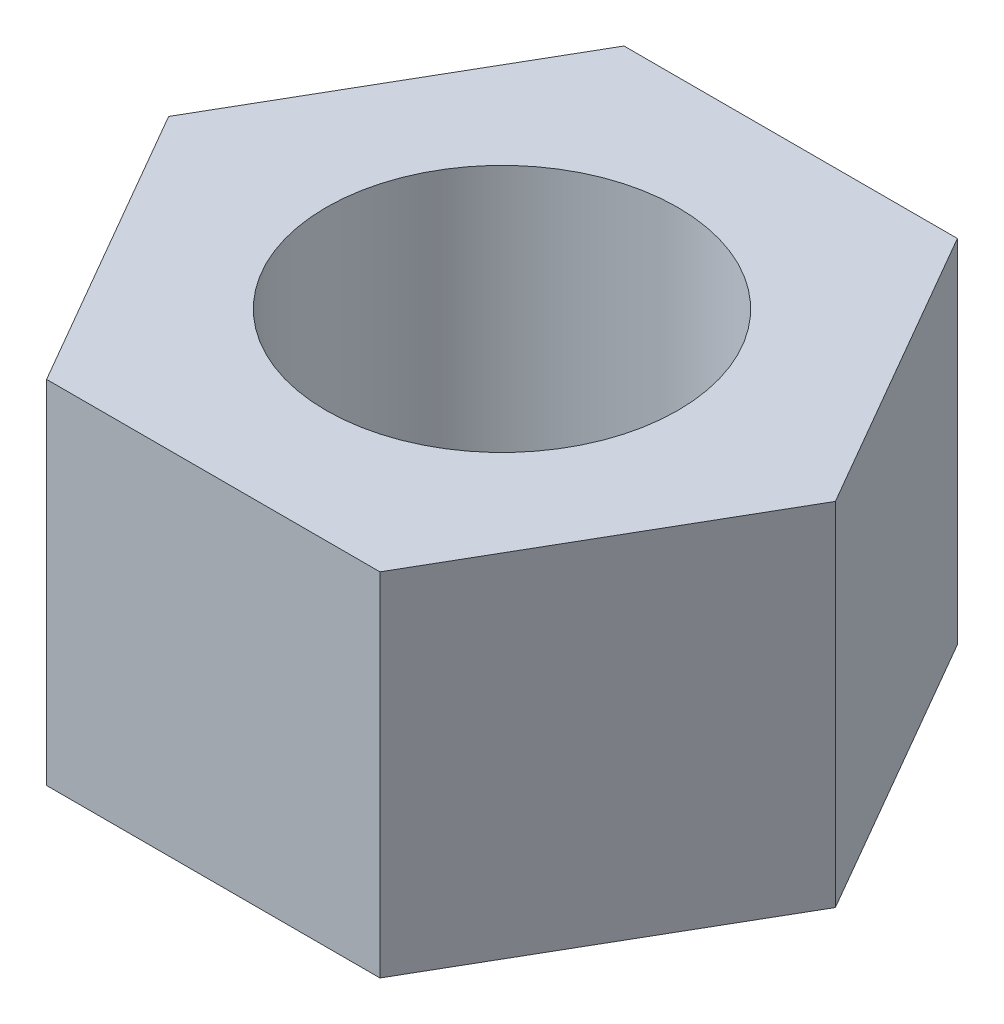
ISO-10303-21;
HEADER;
FILE_DESCRIPTION(('STEP AP214'),'2;1');
FILE_NAME('part.step','',(''),(''),'','','');
FILE_SCHEMA(('AUTOMOTIVE_DESIGN { 1 0 10303 214 1 1 1 1 }'));
ENDSEC;
DATA;
#1=APPLICATION_CONTEXT('core data for automotive mechanical design processes');
#2=APPLICATION_PROTOCOL_DEFINITION('international standard','automotive_design',2000,#1);
#3=PRODUCT_CONTEXT('',#1,'mechanical');
#4=PRODUCT('Part','Part','',(#3));
#5=PRODUCT_RELATED_PRODUCT_CATEGORY('part','',(#4));
#6=PRODUCT_DEFINITION_FORMATION('','',#4);
#7=PRODUCT_DEFINITION_CONTEXT('part definition',#1,'design');
#8=PRODUCT_DEFINITION('design','',#6,#7);
#9=PRODUCT_DEFINITION_SHAPE('','',#8);
#10=(LENGTH_UNIT() NAMED_UNIT(*) SI_UNIT(.MILLI.,.METRE.));
#11=(NAMED_UNIT(*) PLANE_ANGLE_UNIT() SI_UNIT($,.RADIAN.));
#12=(NAMED_UNIT(*) SI_UNIT($,.STERADIAN.) SOLID_ANGLE_UNIT());
#13=UNCERTAINTY_MEASURE_WITH_UNIT(LENGTH_MEASURE(1.E-05),#10,'distance_accuracy_value','');
#14=(GEOMETRIC_REPRESENTATION_CONTEXT(3) GLOBAL_UNCERTAINTY_ASSIGNED_CONTEXT((#13)) GLOBAL_UNIT_ASSIGNED_CONTEXT((#10,
#11,#12)) REPRESENTATION_CONTEXT('',''));
#15=CARTESIAN_POINT('',(0.,0.,0.));
#16=DIRECTION('',(0.,0.,1.));
#17=DIRECTION('',(1.,0.,0.));
#18=AXIS2_PLACEMENT_3D('',#15,#16,#17);
#19=CARTESIAN_POINT('',(0.,6.,0.));
#20=DIRECTION('',(0.,1.,0.));
#21=DIRECTION('',(0.,0.,1.));
#22=AXIS2_PLACEMENT_3D('',#19,#20,#21);
#23=PLANE('',#22);
#24=DIRECTION('',(-0.5,0.,-0.866025403784439));
#25=VECTOR('',#24,1.);
#26=CARTESIAN_POINT('',(5.68690015151781,6.,0.));
#27=LINE('',#26,#25);
#28=CARTESIAN_POINT('',(5.68690015151781,6.,0.));
#29=VERTEX_POINT('',#28);
#30=CARTESIAN_POINT('',(2.84345007575891,6.,-4.925));
#31=VERTEX_POINT('',#30);
#32=EDGE_CURVE('E130',#29,#31,#27,.T.);
#33=ORIENTED_EDGE('',*,*,#32,.T.);
#34=DIRECTION('',(-1.,0.,0.));
#35=VECTOR('',#34,1.);
#36=CARTESIAN_POINT('',(2.84345007575891,6.,-4.925));
#37=LINE('',#36,#35);
#38=CARTESIAN_POINT('',(-2.84345007575891,6.,-4.925));
#39=VERTEX_POINT('',#38);
#40=EDGE_CURVE('E88',#31,#39,#37,.T.);
#41=ORIENTED_EDGE('',*,*,#40,.T.);
#42=DIRECTION('',(-0.5,0.,0.866025403784439));
#43=VECTOR('',#42,1.);
#44=CARTESIAN_POINT('',(-2.84345007575891,6.,-4.925));
#45=LINE('',#44,#43);
#46=CARTESIAN_POINT('',(-5.68690015151781,6.,0.));
#47=VERTEX_POINT('',#46);
#48=EDGE_CURVE('E101',#39,#47,#45,.T.);
#49=ORIENTED_EDGE('',*,*,#48,.T.);
#50=DIRECTION('',(0.5,0.,0.866025403784439));
#51=VECTOR('',#50,1.);
#52=CARTESIAN_POINT('',(-5.68690015151781,6.,0.));
#53=LINE('',#52,#51);
#54=CARTESIAN_POINT('',(-2.8434500757589,6.,4.925));
#55=VERTEX_POINT('',#54);
#56=EDGE_CURVE('E95',#47,#55,#53,.T.);
#57=ORIENTED_EDGE('',*,*,#56,.T.);
#58=DIRECTION('',(1.,0.,0.));
#59=VECTOR('',#58,1.);
#60=CARTESIAN_POINT('',(-2.8434500757589,6.,4.925));
#61=LINE('',#60,#59);
#62=CARTESIAN_POINT('',(2.84345007575891,6.,4.925));
#63=VERTEX_POINT('',#62);
#64=EDGE_CURVE('E99',#55,#63,#61,.T.);
#65=ORIENTED_EDGE('',*,*,#64,.T.);
#66=DIRECTION('',(0.5,0.,-0.866025403784439));
#67=VECTOR('',#66,1.);
#68=CARTESIAN_POINT('',(2.84345007575891,6.,4.925));
#69=LINE('',#68,#67);
#70=EDGE_CURVE('E51',#63,#29,#69,.T.);
#71=ORIENTED_EDGE('',*,*,#70,.T.);
#72=EDGE_LOOP('',(#33,#41,#49,#57,#65,#71));
#73=FACE_BOUND('',#72,.T.);
#74=CARTESIAN_POINT('',(0.,6.,0.));
#75=DIRECTION('',(0.,1.,0.));
#76=DIRECTION('',(0.,0.,1.));
#77=AXIS2_PLACEMENT_3D('',#74,#75,#76);
#78=CIRCLE('',#77,3.);
#79=CARTESIAN_POINT('',(0.,6.,3.));
#80=VERTEX_POINT('',#79);
#81=EDGE_CURVE('E123',#80,#80,#78,.T.);
#82=ORIENTED_EDGE('',*,*,#81,.F.);
#83=EDGE_LOOP('',(#82));
#84=FACE_BOUND('',#83,.T.);
#85=ADVANCED_FACE('F34',(#73,#84),#23,.T.);
#86=CARTESIAN_POINT('',(0.,0.,0.));
#87=DIRECTION('',(0.,1.,0.));
#88=DIRECTION('',(0.,0.,1.));
#89=AXIS2_PLACEMENT_3D('',#86,#87,#88);
#90=PLANE('',#89);
#91=DIRECTION('',(-0.5,0.,-0.866025403784439));
#92=VECTOR('',#91,1.);
#93=CARTESIAN_POINT('',(5.68690015151781,0.,0.));
#94=LINE('',#93,#92);
#95=CARTESIAN_POINT('',(5.68690015151781,0.,0.));
#96=VERTEX_POINT('',#95);
#97=CARTESIAN_POINT('',(2.84345007575891,0.,-4.925));
#98=VERTEX_POINT('',#97);
#99=EDGE_CURVE('E119',#96,#98,#94,.T.);
#100=ORIENTED_EDGE('',*,*,#99,.F.);
#101=DIRECTION('',(0.5,0.,-0.866025403784439));
#102=VECTOR('',#101,1.);
#103=CARTESIAN_POINT('',(2.84345007575891,0.,4.925));
#104=LINE('',#103,#102);
#105=CARTESIAN_POINT('',(2.84345007575891,0.,4.925));
#106=VERTEX_POINT('',#105);
#107=EDGE_CURVE('E80',#106,#96,#104,.T.);
#108=ORIENTED_EDGE('',*,*,#107,.F.);
#109=DIRECTION('',(1.,0.,0.));
#110=VECTOR('',#109,1.);
#111=CARTESIAN_POINT('',(-2.8434500757589,0.,4.925));
#112=LINE('',#111,#110);
#113=CARTESIAN_POINT('',(-2.8434500757589,0.,4.925));
#114=VERTEX_POINT('',#113);
#115=EDGE_CURVE('E74',#114,#106,#112,.T.);
#116=ORIENTED_EDGE('',*,*,#115,.F.);
#117=DIRECTION('',(0.5,0.,0.866025403784439));
#118=VECTOR('',#117,1.);
#119=CARTESIAN_POINT('',(-5.68690015151781,0.,0.));
#120=LINE('',#119,#118);
#121=CARTESIAN_POINT('',(-5.68690015151781,0.,0.));
#122=VERTEX_POINT('',#121);
#123=EDGE_CURVE('E109',#122,#114,#120,.T.);
#124=ORIENTED_EDGE('',*,*,#123,.F.);
#125=DIRECTION('',(-0.5,0.,0.866025403784439));
#126=VECTOR('',#125,1.);
#127=CARTESIAN_POINT('',(-2.84345007575891,0.,-4.925));
#128=LINE('',#127,#126);
#129=CARTESIAN_POINT('',(-2.84345007575891,0.,-4.925));
#130=VERTEX_POINT('',#129);
#131=EDGE_CURVE('E125',#130,#122,#128,.T.);
#132=ORIENTED_EDGE('',*,*,#131,.F.);
#133=DIRECTION('',(-1.,0.,0.));
#134=VECTOR('',#133,1.);
#135=CARTESIAN_POINT('',(2.84345007575891,0.,-4.925));
#136=LINE('',#135,#134);
#137=EDGE_CURVE('E122',#98,#130,#136,.T.);
#138=ORIENTED_EDGE('',*,*,#137,.F.);
#139=EDGE_LOOP('',(#100,#108,#116,#124,#132,#138));
#140=FACE_BOUND('',#139,.T.);
#141=CARTESIAN_POINT('',(0.,0.,0.));
#142=DIRECTION('',(0.,1.,0.));
#143=DIRECTION('',(0.,0.,1.));
#144=AXIS2_PLACEMENT_3D('',#141,#142,#143);
#145=CIRCLE('',#144,3.);
#146=CARTESIAN_POINT('',(0.,0.,3.));
#147=VERTEX_POINT('',#146);
#148=EDGE_CURVE('E223',#147,#147,#145,.T.);
#149=ORIENTED_EDGE('',*,*,#148,.T.);
#150=EDGE_LOOP('',(#149));
#151=FACE_BOUND('',#150,.T.);
#152=ADVANCED_FACE('F139',(#140,#151),#90,.F.);
#153=CARTESIAN_POINT('',(5.68690015151781,6.,0.));
#154=DIRECTION('',(-0.866025403784439,0.,0.5));
#155=DIRECTION('',(0.5,0.,0.866025403784439));
#156=AXIS2_PLACEMENT_3D('',#153,#154,#155);
#157=PLANE('',#156);
#158=ORIENTED_EDGE('',*,*,#99,.T.);
#159=DIRECTION('',(0.,-1.,0.));
#160=VECTOR('',#159,1.);
#161=CARTESIAN_POINT('',(2.84345007575891,6.,-4.925));
#162=LINE('',#161,#160);
#163=EDGE_CURVE('E11',#31,#98,#162,.T.);
#164=ORIENTED_EDGE('',*,*,#163,.F.);
#165=ORIENTED_EDGE('',*,*,#32,.F.);
#166=DIRECTION('',(0.,-1.,0.));
#167=VECTOR('',#166,1.);
#168=CARTESIAN_POINT('',(5.68690015151781,6.,0.));
#169=LINE('',#168,#167);
#170=EDGE_CURVE('E115',#29,#96,#169,.T.);
#171=ORIENTED_EDGE('',*,*,#170,.T.);
#172=EDGE_LOOP('',(#158,#164,#165,#171));
#173=FACE_BOUND('',#172,.T.);
#174=ADVANCED_FACE('F36',(#173),#157,.F.);
#175=CARTESIAN_POINT('',(2.84345007575891,6.,-4.925));
#176=DIRECTION('',(0.,0.,1.));
#177=DIRECTION('',(1.,0.,0.));
#178=AXIS2_PLACEMENT_3D('',#175,#176,#177);
#179=PLANE('',#178);
#180=ORIENTED_EDGE('',*,*,#137,.T.);
#181=DIRECTION('',(0.,-1.,0.));
#182=VECTOR('',#181,1.);
#183=CARTESIAN_POINT('',(-2.84345007575891,6.,-4.925));
#184=LINE('',#183,#182);
#185=EDGE_CURVE('E43',#39,#130,#184,.T.);
#186=ORIENTED_EDGE('',*,*,#185,.F.);
#187=ORIENTED_EDGE('',*,*,#40,.F.);
#188=ORIENTED_EDGE('',*,*,#163,.T.);
#189=EDGE_LOOP('',(#180,#186,#187,#188));
#190=FACE_BOUND('',#189,.T.);
#191=ADVANCED_FACE('F164',(#190),#179,.F.);
#192=CARTESIAN_POINT('',(-2.84345007575891,6.,-4.925));
#193=DIRECTION('',(0.866025403784439,0.,0.5));
#194=DIRECTION('',(0.5,0.,-0.866025403784439));
#195=AXIS2_PLACEMENT_3D('',#192,#193,#194);
#196=PLANE('',#195);
#197=ORIENTED_EDGE('',*,*,#131,.T.);
#198=DIRECTION('',(0.,-1.,0.));
#199=VECTOR('',#198,1.);
#200=CARTESIAN_POINT('',(-5.68690015151781,6.,0.));
#201=LINE('',#200,#199);
#202=EDGE_CURVE('E110',#47,#122,#201,.T.);
#203=ORIENTED_EDGE('',*,*,#202,.F.);
#204=ORIENTED_EDGE('',*,*,#48,.F.);
#205=ORIENTED_EDGE('',*,*,#185,.T.);
#206=EDGE_LOOP('',(#197,#203,#204,#205));
#207=FACE_BOUND('',#206,.T.);
#208=ADVANCED_FACE('F136',(#207),#196,.F.);
#209=CARTESIAN_POINT('',(-5.68690015151781,6.,0.));
#210=DIRECTION('',(0.866025403784438,0.,-0.5));
#211=DIRECTION('',(-0.5,0.,-0.866025403784439));
#212=AXIS2_PLACEMENT_3D('',#209,#210,#211);
#213=PLANE('',#212);
#214=ORIENTED_EDGE('',*,*,#123,.T.);
#215=DIRECTION('',(0.,-1.,0.));
#216=VECTOR('',#215,1.);
#217=CARTESIAN_POINT('',(-2.8434500757589,6.,4.925));
#218=LINE('',#217,#216);
#219=EDGE_CURVE('E106',#55,#114,#218,.T.);
#220=ORIENTED_EDGE('',*,*,#219,.F.);
#221=ORIENTED_EDGE('',*,*,#56,.F.);
#222=ORIENTED_EDGE('',*,*,#202,.T.);
#223=EDGE_LOOP('',(#214,#220,#221,#222));
#224=FACE_BOUND('',#223,.T.);
#225=ADVANCED_FACE('F107',(#224),#213,.F.);
#226=CARTESIAN_POINT('',(-2.8434500757589,6.,4.925));
#227=DIRECTION('',(0.,0.,-1.));
#228=DIRECTION('',(-1.,0.,0.));
#229=AXIS2_PLACEMENT_3D('',#226,#227,#228);
#230=PLANE('',#229);
#231=ORIENTED_EDGE('',*,*,#115,.T.);
#232=DIRECTION('',(0.,-1.,0.));
#233=VECTOR('',#232,1.);
#234=CARTESIAN_POINT('',(2.84345007575891,6.,4.925));
#235=LINE('',#234,#233);
#236=EDGE_CURVE('E111',#63,#106,#235,.T.);
#237=ORIENTED_EDGE('',*,*,#236,.F.);
#238=ORIENTED_EDGE('',*,*,#64,.F.);
#239=ORIENTED_EDGE('',*,*,#219,.T.);
#240=EDGE_LOOP('',(#231,#237,#238,#239));
#241=FACE_BOUND('',#240,.T.);
#242=ADVANCED_FACE('F113',(#241),#230,.F.);
#243=CARTESIAN_POINT('',(2.84345007575891,6.,4.925));
#244=DIRECTION('',(-0.866025403784439,0.,-0.5));
#245=DIRECTION('',(-0.5,0.,0.866025403784439));
#246=AXIS2_PLACEMENT_3D('',#243,#244,#245);
#247=PLANE('',#246);
#248=ORIENTED_EDGE('',*,*,#107,.T.);
#249=ORIENTED_EDGE('',*,*,#170,.F.);
#250=ORIENTED_EDGE('',*,*,#70,.F.);
#251=ORIENTED_EDGE('',*,*,#236,.T.);
#252=EDGE_LOOP('',(#248,#249,#250,#251));
#253=FACE_BOUND('',#252,.T.);
#254=ADVANCED_FACE('F144',(#253),#247,.F.);
#255=CARTESIAN_POINT('',(0.,6.,0.));
#256=DIRECTION('',(0.,-1.,0.));
#257=DIRECTION('',(0.,0.,-1.));
#258=AXIS2_PLACEMENT_3D('',#255,#256,#257);
#259=CYLINDRICAL_SURFACE('',#258,3.);
#260=ORIENTED_EDGE('',*,*,#81,.T.);
#261=EDGE_LOOP('',(#260));
#262=FACE_BOUND('',#261,.T.);
#263=ORIENTED_EDGE('',*,*,#148,.F.);
#264=EDGE_LOOP('',(#263));
#265=FACE_BOUND('',#264,.T.);
#266=ADVANCED_FACE('F146',(#262,#265),#259,.F.);
#267=CLOSED_SHELL('',(#85,#152,#174,#191,#208,#225,#242,#254,#266));
#268=MANIFOLD_SOLID_BREP('B2',#267);
#269=ADVANCED_BREP_SHAPE_REPRESENTATION('',(#18,#268),#14);
#270=SHAPE_DEFINITION_REPRESENTATION(#9,#269);
ENDSEC;
END-ISO-10303-21;
